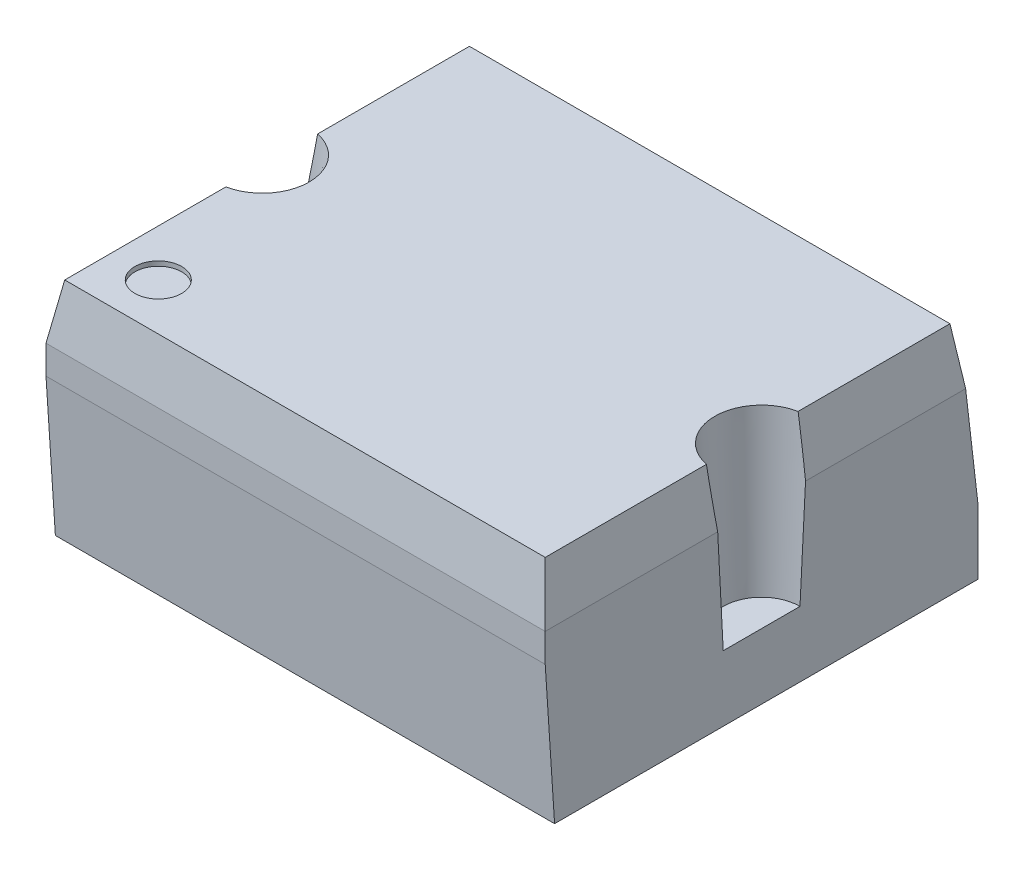
ISO-10303-21;
HEADER;
FILE_DESCRIPTION(('STEP AP214'),'2;1');
FILE_NAME('part.step','',(''),(''),'','','');
FILE_SCHEMA(('AUTOMOTIVE_DESIGN { 1 0 10303 214 1 1 1 1 }'));
ENDSEC;
DATA;
#1=APPLICATION_CONTEXT('core data for automotive mechanical design processes');
#2=APPLICATION_PROTOCOL_DEFINITION('international standard','automotive_design',2000,#1);
#3=PRODUCT_CONTEXT('',#1,'mechanical');
#4=PRODUCT('Part','Part','',(#3));
#5=PRODUCT_RELATED_PRODUCT_CATEGORY('part','',(#4));
#6=PRODUCT_DEFINITION_FORMATION('','',#4);
#7=PRODUCT_DEFINITION_CONTEXT('part definition',#1,'design');
#8=PRODUCT_DEFINITION('design','',#6,#7);
#9=PRODUCT_DEFINITION_SHAPE('','',#8);
#10=(LENGTH_UNIT() NAMED_UNIT(*) SI_UNIT(.MILLI.,.METRE.));
#11=(NAMED_UNIT(*) PLANE_ANGLE_UNIT() SI_UNIT($,.RADIAN.));
#12=(NAMED_UNIT(*) SI_UNIT($,.STERADIAN.) SOLID_ANGLE_UNIT());
#13=UNCERTAINTY_MEASURE_WITH_UNIT(LENGTH_MEASURE(1.E-05),#10,'distance_accuracy_value','');
#14=(GEOMETRIC_REPRESENTATION_CONTEXT(3) GLOBAL_UNCERTAINTY_ASSIGNED_CONTEXT((#13)) GLOBAL_UNIT_ASSIGNED_CONTEXT((#10,
#11,#12)) REPRESENTATION_CONTEXT('',''));
#15=CARTESIAN_POINT('',(0.,0.,0.));
#16=DIRECTION('',(0.,0.,1.));
#17=DIRECTION('',(1.,0.,0.));
#18=AXIS2_PLACEMENT_3D('',#15,#16,#17);
#19=CARTESIAN_POINT('',(5.335,4.83,4.625));
#20=DIRECTION('',(-1.,0.,0.));
#21=DIRECTION('',(0.,0.,1.));
#22=AXIS2_PLACEMENT_3D('',#19,#20,#21);
#23=PLANE('',#22);
#24=DIRECTION('',(0.,0.998629534754574,0.0523359562429439));
#25=VECTOR('',#24,1.);
#26=CARTESIAN_POINT('',(5.335,-14.2511366877282,0.));
#27=LINE('',#26,#25);
#28=CARTESIAN_POINT('',(5.335,3.66,0.938682898238844));
#29=VERTEX_POINT('',#28);
#30=CARTESIAN_POINT('',(5.335,1.4,0.820241317059168));
#31=VERTEX_POINT('',#30);
#32=EDGE_CURVE('E282',#29,#31,#27,.F.);
#33=ORIENTED_EDGE('',*,*,#32,.F.);
#34=DIRECTION('',(0.,0.,1.));
#35=VECTOR('',#34,1.);
#36=CARTESIAN_POINT('',(5.335,3.66,-4.625));
#37=LINE('',#36,#35);
#38=CARTESIAN_POINT('',(5.335,3.66,4.625));
#39=VERTEX_POINT('',#38);
#40=EDGE_CURVE('E163',#29,#39,#37,.T.);
#41=ORIENTED_EDGE('',*,*,#40,.T.);
#42=DIRECTION('',(0.,-1.,0.));
#43=VECTOR('',#42,1.);
#44=CARTESIAN_POINT('',(5.335,4.83,4.625));
#45=LINE('',#44,#43);
#46=CARTESIAN_POINT('',(5.335,3.05,4.625));
#47=VERTEX_POINT('',#46);
#48=EDGE_CURVE('E207',#39,#47,#45,.T.);
#49=ORIENTED_EDGE('',*,*,#48,.T.);
#50=DIRECTION('',(0.,-0.997856949050312,-0.0654332425606761));
#51=VECTOR('',#50,1.);
#52=CARTESIAN_POINT('',(5.335,3.05,4.625));
#53=LINE('',#52,#51);
#54=CARTESIAN_POINT('',(5.335,0.,4.425));
#55=VERTEX_POINT('',#54);
#56=EDGE_CURVE('E279',#47,#55,#53,.T.);
#57=ORIENTED_EDGE('',*,*,#56,.T.);
#58=DIRECTION('',(0.,0.,-1.));
#59=VECTOR('',#58,1.);
#60=CARTESIAN_POINT('',(5.335,0.,4.625));
#61=LINE('',#60,#59);
#62=CARTESIAN_POINT('',(5.335,0.,-4.625));
#63=VERTEX_POINT('',#62);
#64=EDGE_CURVE('E194',#55,#63,#61,.T.);
#65=ORIENTED_EDGE('',*,*,#64,.T.);
#66=DIRECTION('',(0.,-1.,0.));
#67=VECTOR('',#66,1.);
#68=CARTESIAN_POINT('',(5.335,4.83,-4.625));
#69=LINE('',#68,#67);
#70=CARTESIAN_POINT('',(5.335,1.39,-4.625));
#71=VERTEX_POINT('',#70);
#72=EDGE_CURVE('E218',#71,#63,#69,.T.);
#73=ORIENTED_EDGE('',*,*,#72,.F.);
#74=DIRECTION('',(0.,-0.993307380301254,-0.115500858174564));
#75=VECTOR('',#74,1.);
#76=CARTESIAN_POINT('',(5.335,4.83,-4.225));
#77=LINE('',#76,#75);
#78=CARTESIAN_POINT('',(5.335,3.66000000000001,-4.36104651162791));
#79=VERTEX_POINT('',#78);
#80=EDGE_CURVE('E187',#79,#71,#77,.T.);
#81=ORIENTED_EDGE('',*,*,#80,.F.);
#82=CARTESIAN_POINT('',(5.335,3.66,-0.938682898238842));
#83=VERTEX_POINT('',#82);
#84=EDGE_CURVE('E181',#79,#83,#37,.T.);
#85=ORIENTED_EDGE('',*,*,#84,.T.);
#86=DIRECTION('',(0.,-0.998629534754574,0.0523359562429439));
#87=VECTOR('',#86,1.);
#88=CARTESIAN_POINT('',(5.335,-14.2511366877282,0.));
#89=LINE('',#88,#87);
#90=CARTESIAN_POINT('',(5.335,1.4,-0.820241317059168));
#91=VERTEX_POINT('',#90);
#92=EDGE_CURVE('E59',#91,#83,#89,.F.);
#93=ORIENTED_EDGE('',*,*,#92,.F.);
#94=DIRECTION('',(0.,0.,-1.));
#95=VECTOR('',#94,1.);
#96=CARTESIAN_POINT('',(5.335,1.4,4.625));
#97=LINE('',#96,#95);
#98=EDGE_CURVE('E11',#31,#91,#97,.T.);
#99=ORIENTED_EDGE('',*,*,#98,.F.);
#100=EDGE_LOOP('',(#33,#41,#49,#57,#65,#73,#81,#85,#93,#99));
#101=FACE_BOUND('',#100,.T.);
#102=ADVANCED_FACE('F44',(#101),#23,.F.);
#103=CARTESIAN_POINT('',(5.135,4.83,-4.625));
#104=DIRECTION('',(-0.985702316478413,-0.168496122474942,0.));
#105=DIRECTION('',(0.168496122474942,-0.985702316478413,0.));
#106=AXIS2_PLACEMENT_3D('',#103,#104,#105);
#107=PLANE('',#106);
#108=CARTESIAN_POINT('',(5.01735664209499,5.5182136437443,0.));
#109=DIRECTION('',(-0.985702316478413,-0.168496122474942,0.));
#110=DIRECTION('',(-0.168496122474942,0.985702316478413,0.));
#111=AXIS2_PLACEMENT_3D('',#108,#109,#110);
#112=ELLIPSE('',#111,6.14891152106488,0.986173958873346);
#113=CARTESIAN_POINT('',(5.135,4.83,0.979795897113271));
#114=VERTEX_POINT('',#113);
#115=EDGE_CURVE('E52',#114,#29,#112,.F.);
#116=ORIENTED_EDGE('',*,*,#115,.F.);
#117=DIRECTION('',(0.,0.,1.));
#118=VECTOR('',#117,1.);
#119=CARTESIAN_POINT('',(5.135,4.83,-4.625));
#120=LINE('',#119,#118);
#121=CARTESIAN_POINT('',(5.135,4.83,4.425));
#122=VERTEX_POINT('',#121);
#123=EDGE_CURVE('E161',#114,#122,#120,.T.);
#124=ORIENTED_EDGE('',*,*,#123,.T.);
#125=DIRECTION('',(0.166153995594193,-0.972000874226032,0.166153995594193));
#126=VECTOR('',#125,1.);
#127=CARTESIAN_POINT('',(4.88515529022017,6.29159155221202,4.17515529022017));
#128=LINE('',#127,#126);
#129=EDGE_CURVE('E243',#122,#39,#128,.T.);
#130=ORIENTED_EDGE('',*,*,#129,.T.);
#131=ORIENTED_EDGE('',*,*,#40,.F.);
#132=EDGE_LOOP('',(#116,#124,#130,#131));
#133=FACE_BOUND('',#132,.T.);
#134=ADVANCED_FACE('F159',(#133),#107,.F.);
#135=CARTESIAN_POINT('',(5.135,4.83,-0.979795897113271));
#136=VERTEX_POINT('',#135);
#137=EDGE_CURVE('E148',#83,#136,#112,.F.);
#138=ORIENTED_EDGE('',*,*,#137,.F.);
#139=ORIENTED_EDGE('',*,*,#84,.F.);
#140=DIRECTION('',(0.167400146236477,-0.97929085548339,-0.113871029707371));
#141=VECTOR('',#140,1.);
#142=CARTESIAN_POINT('',(4.84160119018886,6.54638303739514,-4.02542057704708));
#143=LINE('',#142,#141);
#144=CARTESIAN_POINT('',(5.135,4.83,-4.225));
#145=VERTEX_POINT('',#144);
#146=EDGE_CURVE('E222',#145,#79,#143,.T.);
#147=ORIENTED_EDGE('',*,*,#146,.F.);
#148=EDGE_CURVE('E170',#145,#136,#120,.T.);
#149=ORIENTED_EDGE('',*,*,#148,.T.);
#150=EDGE_LOOP('',(#138,#139,#147,#149));
#151=FACE_BOUND('',#150,.T.);
#152=ADVANCED_FACE('F292',(#151),#107,.F.);
#153=CARTESIAN_POINT('',(-5.135,4.83,-4.625));
#154=DIRECTION('',(-0.985702316478413,0.168496122474942,0.));
#155=DIRECTION('',(-0.168496122474942,-0.985702316478413,0.));
#156=AXIS2_PLACEMENT_3D('',#153,#154,#155);
#157=PLANE('',#156);
#158=CARTESIAN_POINT('',(-5.01735664209499,5.5182136437443,0.));
#159=DIRECTION('',(-0.985702316478413,0.168496122474942,0.));
#160=DIRECTION('',(0.168496122474942,0.985702316478413,0.));
#161=AXIS2_PLACEMENT_3D('',#158,#159,#160);
#162=ELLIPSE('',#161,6.14891152106488,0.986173958873346);
#163=CARTESIAN_POINT('',(-5.135,4.83,-0.979795897113271));
#164=VERTEX_POINT('',#163);
#165=CARTESIAN_POINT('',(-5.335,3.66,-0.938682898238842));
#166=VERTEX_POINT('',#165);
#167=EDGE_CURVE('E236',#164,#166,#162,.T.);
#168=ORIENTED_EDGE('',*,*,#167,.F.);
#169=DIRECTION('',(0.,0.,1.));
#170=VECTOR('',#169,1.);
#171=CARTESIAN_POINT('',(-5.135,4.83,-4.625));
#172=LINE('',#171,#170);
#173=CARTESIAN_POINT('',(-5.135,4.83,-4.225));
#174=VERTEX_POINT('',#173);
#175=EDGE_CURVE('E171',#174,#164,#172,.T.);
#176=ORIENTED_EDGE('',*,*,#175,.F.);
#177=DIRECTION('',(-0.167400146236477,-0.97929085548339,-0.113871029707371));
#178=VECTOR('',#177,1.);
#179=CARTESIAN_POINT('',(-5.140604561792,4.79721331351681,-4.22881240540502));
#180=LINE('',#179,#178);
#181=CARTESIAN_POINT('',(-5.335,3.66,-4.36104651162791));
#182=VERTEX_POINT('',#181);
#183=EDGE_CURVE('E226',#174,#182,#180,.T.);
#184=ORIENTED_EDGE('',*,*,#183,.T.);
#185=DIRECTION('',(0.,0.,1.));
#186=VECTOR('',#185,1.);
#187=CARTESIAN_POINT('',(-5.335,3.66,-4.625));
#188=LINE('',#187,#186);
#189=EDGE_CURVE('E258',#182,#166,#188,.T.);
#190=ORIENTED_EDGE('',*,*,#189,.T.);
#191=EDGE_LOOP('',(#168,#176,#184,#190));
#192=FACE_BOUND('',#191,.T.);
#193=ADVANCED_FACE('F301',(#192),#157,.T.);
#194=CARTESIAN_POINT('',(-5.335,4.83,4.625));
#195=DIRECTION('',(1.,0.,0.));
#196=DIRECTION('',(0.,0.,-1.));
#197=AXIS2_PLACEMENT_3D('',#194,#195,#196);
#198=PLANE('',#197);
#199=DIRECTION('',(0.,0.,1.));
#200=VECTOR('',#199,1.);
#201=CARTESIAN_POINT('',(-5.335,1.4,4.625));
#202=LINE('',#201,#200);
#203=CARTESIAN_POINT('',(-5.335,1.4,-0.820241317059168));
#204=VERTEX_POINT('',#203);
#205=CARTESIAN_POINT('',(-5.335,1.4,0.820241317059168));
#206=VERTEX_POINT('',#205);
#207=EDGE_CURVE('E237',#204,#206,#202,.T.);
#208=ORIENTED_EDGE('',*,*,#207,.F.);
#209=DIRECTION('',(0.,0.998629534754574,-0.0523359562429439));
#210=VECTOR('',#209,1.);
#211=CARTESIAN_POINT('',(-5.335,-14.2511366877282,0.));
#212=LINE('',#211,#210);
#213=EDGE_CURVE('E316',#204,#166,#212,.T.);
#214=ORIENTED_EDGE('',*,*,#213,.T.);
#215=ORIENTED_EDGE('',*,*,#189,.F.);
#216=DIRECTION('',(0.,-0.993307380301254,-0.115500858174564));
#217=VECTOR('',#216,1.);
#218=CARTESIAN_POINT('',(-5.335,4.83,-4.225));
#219=LINE('',#218,#217);
#220=CARTESIAN_POINT('',(-5.335,1.39,-4.625));
#221=VERTEX_POINT('',#220);
#222=EDGE_CURVE('E183',#182,#221,#219,.T.);
#223=ORIENTED_EDGE('',*,*,#222,.T.);
#224=DIRECTION('',(0.,-1.,0.));
#225=VECTOR('',#224,1.);
#226=CARTESIAN_POINT('',(-5.335,4.83,-4.625));
#227=LINE('',#226,#225);
#228=CARTESIAN_POINT('',(-5.335,0.,-4.625));
#229=VERTEX_POINT('',#228);
#230=EDGE_CURVE('E215',#221,#229,#227,.T.);
#231=ORIENTED_EDGE('',*,*,#230,.T.);
#232=DIRECTION('',(0.,0.,1.));
#233=VECTOR('',#232,1.);
#234=CARTESIAN_POINT('',(-5.335,0.,4.625));
#235=LINE('',#234,#233);
#236=CARTESIAN_POINT('',(-5.335,0.,4.425));
#237=VERTEX_POINT('',#236);
#238=EDGE_CURVE('E203',#229,#237,#235,.T.);
#239=ORIENTED_EDGE('',*,*,#238,.T.);
#240=DIRECTION('',(0.,-0.997856949050312,-0.0654332425606761));
#241=VECTOR('',#240,1.);
#242=CARTESIAN_POINT('',(-5.335,3.05,4.625));
#243=LINE('',#242,#241);
#244=CARTESIAN_POINT('',(-5.335,3.05,4.625));
#245=VERTEX_POINT('',#244);
#246=EDGE_CURVE('E319',#245,#237,#243,.T.);
#247=ORIENTED_EDGE('',*,*,#246,.F.);
#248=DIRECTION('',(0.,-1.,0.));
#249=VECTOR('',#248,1.);
#250=CARTESIAN_POINT('',(-5.335,4.83,4.625));
#251=LINE('',#250,#249);
#252=CARTESIAN_POINT('',(-5.335,3.66,4.625));
#253=VERTEX_POINT('',#252);
#254=EDGE_CURVE('E211',#253,#245,#251,.T.);
#255=ORIENTED_EDGE('',*,*,#254,.F.);
#256=CARTESIAN_POINT('',(-5.335,3.66,0.938682898238844));
#257=VERTEX_POINT('',#256);
#258=EDGE_CURVE('E250',#257,#253,#188,.T.);
#259=ORIENTED_EDGE('',*,*,#258,.F.);
#260=DIRECTION('',(0.,-0.998629534754574,-0.0523359562429439));
#261=VECTOR('',#260,1.);
#262=CARTESIAN_POINT('',(-5.335,-14.2511366877282,0.));
#263=LINE('',#262,#261);
#264=EDGE_CURVE('E67',#257,#206,#263,.T.);
#265=ORIENTED_EDGE('',*,*,#264,.T.);
#266=EDGE_LOOP('',(#208,#214,#215,#223,#231,#239,#247,#255,#259,#265));
#267=FACE_BOUND('',#266,.T.);
#268=ADVANCED_FACE('F331',(#267),#198,.F.);
#269=CARTESIAN_POINT('',(-5.335,4.83,4.625));
#270=DIRECTION('',(0.,0.,-1.));
#271=DIRECTION('',(-1.,0.,0.));
#272=AXIS2_PLACEMENT_3D('',#269,#270,#271);
#273=PLANE('',#272);
#274=ORIENTED_EDGE('',*,*,#254,.T.);
#275=DIRECTION('',(-1.,0.,0.));
#276=VECTOR('',#275,1.);
#277=CARTESIAN_POINT('',(5.335,3.05,4.625));
#278=LINE('',#277,#276);
#279=EDGE_CURVE('E256',#47,#245,#278,.T.);
#280=ORIENTED_EDGE('',*,*,#279,.F.);
#281=ORIENTED_EDGE('',*,*,#48,.F.);
#282=DIRECTION('',(-1.,0.,0.));
#283=VECTOR('',#282,1.);
#284=CARTESIAN_POINT('',(5.335,3.66,4.625));
#285=LINE('',#284,#283);
#286=EDGE_CURVE('E241',#39,#253,#285,.T.);
#287=ORIENTED_EDGE('',*,*,#286,.T.);
#288=EDGE_LOOP('',(#274,#280,#281,#287));
#289=FACE_BOUND('',#288,.T.);
#290=ADVANCED_FACE('F276',(#289),#273,.F.);
#291=CARTESIAN_POINT('',(0.,4.83,0.));
#292=DIRECTION('',(0.,-1.,0.));
#293=DIRECTION('',(0.,0.,-1.));
#294=AXIS2_PLACEMENT_3D('',#291,#292,#293);
#295=PLANE('',#294);
#296=CARTESIAN_POINT('',(-4.135,4.83,3.425));
#297=DIRECTION('',(0.,1.,0.));
#298=DIRECTION('',(0.,0.,1.));
#299=AXIS2_PLACEMENT_3D('',#296,#297,#298);
#300=CIRCLE('',#299,0.5);
#301=CARTESIAN_POINT('',(-4.135,4.83,3.925));
#302=VERTEX_POINT('',#301);
#303=EDGE_CURVE('E518',#302,#302,#300,.T.);
#304=ORIENTED_EDGE('',*,*,#303,.F.);
#305=EDGE_LOOP('',(#304));
#306=FACE_BOUND('',#305,.T.);
#307=CARTESIAN_POINT('',(5.335,4.83,0.));
#308=DIRECTION('',(0.,-1.,0.));
#309=DIRECTION('',(0.,0.,1.));
#310=AXIS2_PLACEMENT_3D('',#307,#308,#309);
#311=CIRCLE('',#310,1.);
#312=EDGE_CURVE('E144',#114,#136,#311,.T.);
#313=ORIENTED_EDGE('',*,*,#312,.T.);
#314=ORIENTED_EDGE('',*,*,#148,.F.);
#315=DIRECTION('',(1.,0.,0.));
#316=VECTOR('',#315,1.);
#317=CARTESIAN_POINT('',(-5.335,4.83,-4.225));
#318=LINE('',#317,#316);
#319=EDGE_CURVE('E186',#174,#145,#318,.T.);
#320=ORIENTED_EDGE('',*,*,#319,.F.);
#321=ORIENTED_EDGE('',*,*,#175,.T.);
#322=CARTESIAN_POINT('',(-5.335,4.83,0.));
#323=DIRECTION('',(0.,1.,0.));
#324=DIRECTION('',(0.,0.,1.));
#325=AXIS2_PLACEMENT_3D('',#322,#323,#324);
#326=CIRCLE('',#325,1.);
#327=CARTESIAN_POINT('',(-5.135,4.83,0.979795897113271));
#328=VERTEX_POINT('',#327);
#329=EDGE_CURVE('E300',#328,#164,#326,.T.);
#330=ORIENTED_EDGE('',*,*,#329,.F.);
#331=CARTESIAN_POINT('',(-5.135,4.83,4.425));
#332=VERTEX_POINT('',#331);
#333=EDGE_CURVE('E177',#328,#332,#172,.T.);
#334=ORIENTED_EDGE('',*,*,#333,.T.);
#335=DIRECTION('',(-1.,0.,0.));
#336=VECTOR('',#335,1.);
#337=CARTESIAN_POINT('',(5.335,4.83,4.425));
#338=LINE('',#337,#336);
#339=EDGE_CURVE('E168',#122,#332,#338,.T.);
#340=ORIENTED_EDGE('',*,*,#339,.F.);
#341=ORIENTED_EDGE('',*,*,#123,.F.);
#342=EDGE_LOOP('',(#313,#314,#320,#321,#330,#334,#340,#341));
#343=FACE_BOUND('',#342,.T.);
#344=ADVANCED_FACE('F166',(#306,#343),#295,.F.);
#345=CARTESIAN_POINT('',(-5.335,4.83,-4.225));
#346=DIRECTION('',(0.,-0.115500858174564,0.993307380301253));
#347=DIRECTION('',(0.,-0.993307380301254,-0.115500858174564));
#348=AXIS2_PLACEMENT_3D('',#345,#346,#347);
#349=PLANE('',#348);
#350=ORIENTED_EDGE('',*,*,#183,.F.);
#351=ORIENTED_EDGE('',*,*,#319,.T.);
#352=ORIENTED_EDGE('',*,*,#146,.T.);
#353=ORIENTED_EDGE('',*,*,#80,.T.);
#354=DIRECTION('',(1.,0.,0.));
#355=VECTOR('',#354,1.);
#356=CARTESIAN_POINT('',(-5.335,1.39,-4.625));
#357=LINE('',#356,#355);
#358=EDGE_CURVE('E190',#221,#71,#357,.T.);
#359=ORIENTED_EDGE('',*,*,#358,.F.);
#360=ORIENTED_EDGE('',*,*,#222,.F.);
#361=EDGE_LOOP('',(#350,#351,#352,#353,#359,#360));
#362=FACE_BOUND('',#361,.T.);
#363=ADVANCED_FACE('F295',(#362),#349,.F.);
#364=CARTESIAN_POINT('',(-5.335,4.83,-4.625));
#365=DIRECTION('',(0.,0.,1.));
#366=DIRECTION('',(1.,0.,0.));
#367=AXIS2_PLACEMENT_3D('',#364,#365,#366);
#368=PLANE('',#367);
#369=ORIENTED_EDGE('',*,*,#230,.F.);
#370=ORIENTED_EDGE('',*,*,#358,.T.);
#371=ORIENTED_EDGE('',*,*,#72,.T.);
#372=DIRECTION('',(-1.,0.,0.));
#373=VECTOR('',#372,1.);
#374=CARTESIAN_POINT('',(-5.335,0.,-4.625));
#375=LINE('',#374,#373);
#376=EDGE_CURVE('E199',#63,#229,#375,.T.);
#377=ORIENTED_EDGE('',*,*,#376,.T.);
#378=EDGE_LOOP('',(#369,#370,#371,#377));
#379=FACE_BOUND('',#378,.T.);
#380=ADVANCED_FACE('F336',(#379),#368,.F.);
#381=CARTESIAN_POINT('',(0.,0.,0.));
#382=DIRECTION('',(0.,-1.,0.));
#383=DIRECTION('',(0.,0.,-1.));
#384=AXIS2_PLACEMENT_3D('',#381,#382,#383);
#385=PLANE('',#384);
#386=DIRECTION('',(-1.,0.,0.));
#387=VECTOR('',#386,1.);
#388=CARTESIAN_POINT('',(5.335,0.,4.425));
#389=LINE('',#388,#387);
#390=EDGE_CURVE('E253',#55,#237,#389,.T.);
#391=ORIENTED_EDGE('',*,*,#390,.T.);
#392=ORIENTED_EDGE('',*,*,#238,.F.);
#393=ORIENTED_EDGE('',*,*,#376,.F.);
#394=ORIENTED_EDGE('',*,*,#64,.F.);
#395=EDGE_LOOP('',(#391,#392,#393,#394));
#396=FACE_BOUND('',#395,.T.);
#397=ADVANCED_FACE('F334',(#396),#385,.T.);
#398=EDGE_CURVE('E233',#257,#328,#162,.T.);
#399=ORIENTED_EDGE('',*,*,#398,.F.);
#400=ORIENTED_EDGE('',*,*,#258,.T.);
#401=DIRECTION('',(-0.166153995594193,-0.972000874226032,0.166153995594193));
#402=VECTOR('',#401,1.);
#403=CARTESIAN_POINT('',(-4.88515529022017,6.29159155221202,4.17515529022017));
#404=LINE('',#403,#402);
#405=EDGE_CURVE('E229',#332,#253,#404,.T.);
#406=ORIENTED_EDGE('',*,*,#405,.F.);
#407=ORIENTED_EDGE('',*,*,#333,.F.);
#408=EDGE_LOOP('',(#399,#400,#406,#407));
#409=FACE_BOUND('',#408,.T.);
#410=ADVANCED_FACE('F270',(#409),#157,.T.);
#411=CARTESIAN_POINT('',(5.335,4.83,4.425));
#412=DIRECTION('',(0.,-0.168496122474942,-0.985702316478413));
#413=DIRECTION('',(0.,0.985702316478413,-0.168496122474942));
#414=AXIS2_PLACEMENT_3D('',#411,#412,#413);
#415=PLANE('',#414);
#416=ORIENTED_EDGE('',*,*,#339,.T.);
#417=ORIENTED_EDGE('',*,*,#405,.T.);
#418=ORIENTED_EDGE('',*,*,#286,.F.);
#419=ORIENTED_EDGE('',*,*,#129,.F.);
#420=EDGE_LOOP('',(#416,#417,#418,#419));
#421=FACE_BOUND('',#420,.T.);
#422=ADVANCED_FACE('F274',(#421),#415,.F.);
#423=CARTESIAN_POINT('',(5.335,3.05,4.625));
#424=DIRECTION('',(0.,0.065433242560676,-0.997856949050311));
#425=DIRECTION('',(0.,0.997856949050312,0.0654332425606761));
#426=AXIS2_PLACEMENT_3D('',#423,#424,#425);
#427=PLANE('',#426);
#428=ORIENTED_EDGE('',*,*,#246,.T.);
#429=ORIENTED_EDGE('',*,*,#390,.F.);
#430=ORIENTED_EDGE('',*,*,#56,.F.);
#431=ORIENTED_EDGE('',*,*,#279,.T.);
#432=EDGE_LOOP('',(#428,#429,#430,#431));
#433=FACE_BOUND('',#432,.T.);
#434=ADVANCED_FACE('F329',(#433),#427,.F.);
#435=CARTESIAN_POINT('',(-5.335,1.4,0.));
#436=DIRECTION('',(0.,1.,0.));
#437=DIRECTION('',(0.,0.,1.));
#438=AXIS2_PLACEMENT_3D('',#435,#436,#437);
#439=PLANE('',#438);
#440=ORIENTED_EDGE('',*,*,#207,.T.);
#441=CARTESIAN_POINT('',(-5.335,1.4,0.));
#442=DIRECTION('',(0.,1.,0.));
#443=DIRECTION('',(0.,0.,1.));
#444=AXIS2_PLACEMENT_3D('',#441,#442,#443);
#445=CIRCLE('',#444,0.820241317059168);
#446=EDGE_CURVE('E307',#206,#204,#445,.T.);
#447=ORIENTED_EDGE('',*,*,#446,.T.);
#448=EDGE_LOOP('',(#440,#447));
#449=FACE_BOUND('',#448,.T.);
#450=ADVANCED_FACE('F339',(#449),#439,.T.);
#451=CARTESIAN_POINT('',(-5.335,4.83,0.));
#452=DIRECTION('',(0.,1.,0.));
#453=DIRECTION('',(0.,0.,1.));
#454=AXIS2_PLACEMENT_3D('',#451,#452,#453);
#455=CONICAL_SURFACE('',#454,1.,0.0523598775598299);
#456=ORIENTED_EDGE('',*,*,#446,.F.);
#457=ORIENTED_EDGE('',*,*,#264,.F.);
#458=ORIENTED_EDGE('',*,*,#398,.T.);
#459=ORIENTED_EDGE('',*,*,#329,.T.);
#460=ORIENTED_EDGE('',*,*,#167,.T.);
#461=ORIENTED_EDGE('',*,*,#213,.F.);
#462=EDGE_LOOP('',(#456,#457,#458,#459,#460,#461));
#463=FACE_BOUND('',#462,.T.);
#464=ADVANCED_FACE('F337',(#463),#455,.F.);
#465=CARTESIAN_POINT('',(5.335,1.4,0.));
#466=DIRECTION('',(0.,1.,0.));
#467=DIRECTION('',(0.,0.,1.));
#468=AXIS2_PLACEMENT_3D('',#465,#466,#467);
#469=PLANE('',#468);
#470=ORIENTED_EDGE('',*,*,#98,.T.);
#471=CARTESIAN_POINT('',(5.335,1.4,0.));
#472=DIRECTION('',(0.,1.,0.));
#473=DIRECTION('',(0.,0.,1.));
#474=AXIS2_PLACEMENT_3D('',#471,#472,#473);
#475=CIRCLE('',#474,0.820241317059168);
#476=EDGE_CURVE('E154',#31,#91,#475,.F.);
#477=ORIENTED_EDGE('',*,*,#476,.F.);
#478=EDGE_LOOP('',(#470,#477));
#479=FACE_BOUND('',#478,.T.);
#480=ADVANCED_FACE('F346',(#479),#469,.T.);
#481=CARTESIAN_POINT('',(5.335,4.83,0.));
#482=DIRECTION('',(0.,1.,0.));
#483=DIRECTION('',(0.,0.,1.));
#484=AXIS2_PLACEMENT_3D('',#481,#482,#483);
#485=CONICAL_SURFACE('',#484,1.,0.0523598775598299);
#486=ORIENTED_EDGE('',*,*,#32,.T.);
#487=ORIENTED_EDGE('',*,*,#476,.T.);
#488=ORIENTED_EDGE('',*,*,#92,.T.);
#489=ORIENTED_EDGE('',*,*,#137,.T.);
#490=ORIENTED_EDGE('',*,*,#312,.F.);
#491=ORIENTED_EDGE('',*,*,#115,.T.);
#492=EDGE_LOOP('',(#486,#487,#488,#489,#490,#491));
#493=FACE_BOUND('',#492,.T.);
#494=ADVANCED_FACE('F146',(#493),#485,.F.);
#495=CARTESIAN_POINT('',(-4.135,4.73,3.425));
#496=DIRECTION('',(0.,1.,0.));
#497=DIRECTION('',(0.,0.,1.));
#498=AXIS2_PLACEMENT_3D('',#495,#496,#497);
#499=CYLINDRICAL_SURFACE('',#498,0.5);
#500=CARTESIAN_POINT('',(-4.135,4.73,3.425));
#501=DIRECTION('',(0.,1.,0.));
#502=DIRECTION('',(0.,0.,1.));
#503=AXIS2_PLACEMENT_3D('',#500,#501,#502);
#504=CIRCLE('',#503,0.5);
#505=CARTESIAN_POINT('',(-4.135,4.73,3.925));
#506=VERTEX_POINT('',#505);
#507=EDGE_CURVE('E155',#506,#506,#504,.T.);
#508=ORIENTED_EDGE('',*,*,#507,.F.);
#509=EDGE_LOOP('',(#508));
#510=FACE_BOUND('',#509,.T.);
#511=ORIENTED_EDGE('',*,*,#303,.T.);
#512=EDGE_LOOP('',(#511));
#513=FACE_BOUND('',#512,.T.);
#514=ADVANCED_FACE('F416',(#510,#513),#499,.F.);
#515=CARTESIAN_POINT('',(-4.135,4.73,3.425));
#516=DIRECTION('',(0.,1.,0.));
#517=DIRECTION('',(0.,0.,1.));
#518=AXIS2_PLACEMENT_3D('',#515,#516,#517);
#519=PLANE('',#518);
#520=ORIENTED_EDGE('',*,*,#507,.T.);
#521=EDGE_LOOP('',(#520));
#522=FACE_BOUND('',#521,.T.);
#523=ADVANCED_FACE('F424',(#522),#519,.T.);
#524=CLOSED_SHELL('',(#102,#134,#152,#193,#268,#290,#344,#363,#380,#397,#410,#422,#434,#450,
#464,#480,#494,#514,#523));
#525=MANIFOLD_SOLID_BREP('B2',#524);
#526=ADVANCED_BREP_SHAPE_REPRESENTATION('',(#18,#525),#14);
#527=SHAPE_DEFINITION_REPRESENTATION(#9,#526);
ENDSEC;
END-ISO-10303-21;
